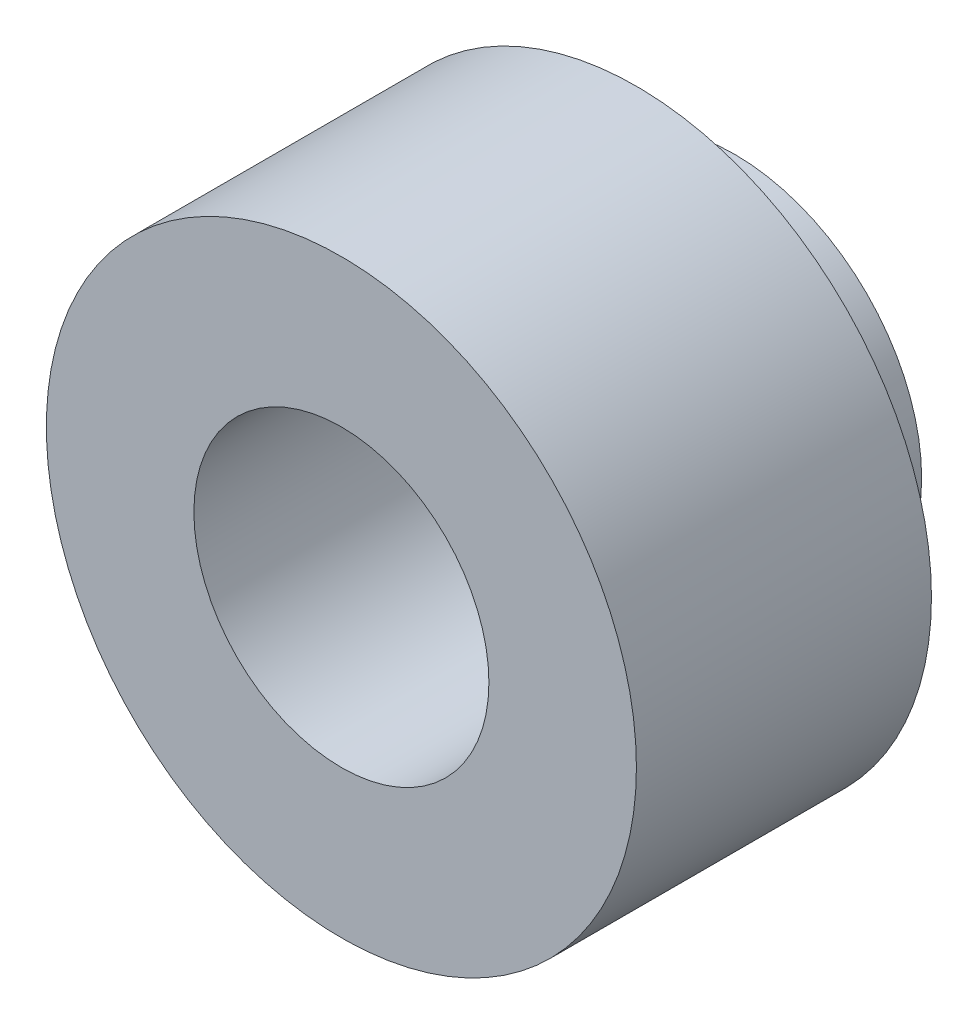
ISO-10303-21;
HEADER;
FILE_DESCRIPTION(('STEP AP214'),'2;1');
FILE_NAME('part.step','',(''),(''),'','','');
FILE_SCHEMA(('AUTOMOTIVE_DESIGN { 1 0 10303 214 1 1 1 1 }'));
ENDSEC;
DATA;
#1=APPLICATION_CONTEXT('core data for automotive mechanical design processes');
#2=APPLICATION_PROTOCOL_DEFINITION('international standard','automotive_design',2000,#1);
#3=PRODUCT_CONTEXT('',#1,'mechanical');
#4=PRODUCT('Part','Part','',(#3));
#5=PRODUCT_RELATED_PRODUCT_CATEGORY('part','',(#4));
#6=PRODUCT_DEFINITION_FORMATION('','',#4);
#7=PRODUCT_DEFINITION_CONTEXT('part definition',#1,'design');
#8=PRODUCT_DEFINITION('design','',#6,#7);
#9=PRODUCT_DEFINITION_SHAPE('','',#8);
#10=(LENGTH_UNIT() NAMED_UNIT(*) SI_UNIT(.MILLI.,.METRE.));
#11=(NAMED_UNIT(*) PLANE_ANGLE_UNIT() SI_UNIT($,.RADIAN.));
#12=(NAMED_UNIT(*) SI_UNIT($,.STERADIAN.) SOLID_ANGLE_UNIT());
#13=UNCERTAINTY_MEASURE_WITH_UNIT(LENGTH_MEASURE(1.E-05),#10,'distance_accuracy_value','');
#14=(GEOMETRIC_REPRESENTATION_CONTEXT(3) GLOBAL_UNCERTAINTY_ASSIGNED_CONTEXT((#13)) GLOBAL_UNIT_ASSIGNED_CONTEXT((#10,
#11,#12)) REPRESENTATION_CONTEXT('',''));
#15=CARTESIAN_POINT('',(0.,0.,0.));
#16=DIRECTION('',(0.,0.,1.));
#17=DIRECTION('',(1.,0.,0.));
#18=AXIS2_PLACEMENT_3D('',#15,#16,#17);
#19=CARTESIAN_POINT('',(0.,0.,0.));
#20=DIRECTION('',(0.,0.,1.));
#21=DIRECTION('',(1.,0.,0.));
#22=AXIS2_PLACEMENT_3D('',#19,#20,#21);
#23=PLANE('',#22);
#24=CARTESIAN_POINT('',(0.,0.,0.));
#25=DIRECTION('',(0.,0.,1.));
#26=DIRECTION('',(1.,0.,0.));
#27=AXIS2_PLACEMENT_3D('',#24,#25,#26);
#28=CIRCLE('',#27,3.75);
#29=CARTESIAN_POINT('',(3.75,0.,0.));
#30=VERTEX_POINT('',#29);
#31=EDGE_CURVE('E56',#30,#30,#28,.T.);
#32=ORIENTED_EDGE('',*,*,#31,.F.);
#33=EDGE_LOOP('',(#32));
#34=FACE_BOUND('',#33,.T.);
#35=CARTESIAN_POINT('',(0.,0.,0.));
#36=DIRECTION('',(0.,0.,1.));
#37=DIRECTION('',(1.,0.,0.));
#38=AXIS2_PLACEMENT_3D('',#35,#36,#37);
#39=CIRCLE('',#38,2.375);
#40=CARTESIAN_POINT('',(2.375,0.,0.));
#41=VERTEX_POINT('',#40);
#42=EDGE_CURVE('E11',#41,#41,#39,.F.);
#43=ORIENTED_EDGE('',*,*,#42,.F.);
#44=EDGE_LOOP('',(#43));
#45=FACE_BOUND('',#44,.T.);
#46=ADVANCED_FACE('F43',(#34,#45),#23,.F.);
#47=CARTESIAN_POINT('',(0.,0.,3.75));
#48=DIRECTION('',(0.,0.,1.));
#49=DIRECTION('',(1.,0.,0.));
#50=AXIS2_PLACEMENT_3D('',#47,#48,#49);
#51=PLANE('',#50);
#52=CARTESIAN_POINT('',(0.,0.,3.75));
#53=DIRECTION('',(0.,0.,1.));
#54=DIRECTION('',(1.,0.,0.));
#55=AXIS2_PLACEMENT_3D('',#52,#53,#54);
#56=CIRCLE('',#55,3.75);
#57=CARTESIAN_POINT('',(3.75,0.,3.75));
#58=VERTEX_POINT('',#57);
#59=EDGE_CURVE('E51',#58,#58,#56,.T.);
#60=ORIENTED_EDGE('',*,*,#59,.T.);
#61=EDGE_LOOP('',(#60));
#62=FACE_BOUND('',#61,.T.);
#63=CARTESIAN_POINT('',(0.,0.,3.75));
#64=DIRECTION('',(0.,0.,1.));
#65=DIRECTION('',(1.,0.,0.));
#66=AXIS2_PLACEMENT_3D('',#63,#64,#65);
#67=CIRCLE('',#66,1.875);
#68=CARTESIAN_POINT('',(1.875,0.,3.75));
#69=VERTEX_POINT('',#68);
#70=EDGE_CURVE('E62',#69,#69,#67,.T.);
#71=ORIENTED_EDGE('',*,*,#70,.F.);
#72=EDGE_LOOP('',(#71));
#73=FACE_BOUND('',#72,.T.);
#74=ADVANCED_FACE('F92',(#62,#73),#51,.T.);
#75=CARTESIAN_POINT('',(0.,0.,3.75));
#76=DIRECTION('',(0.,0.,-1.));
#77=DIRECTION('',(-1.,0.,0.));
#78=AXIS2_PLACEMENT_3D('',#75,#76,#77);
#79=CYLINDRICAL_SURFACE('',#78,3.75);
#80=ORIENTED_EDGE('',*,*,#59,.F.);
#81=EDGE_LOOP('',(#80));
#82=FACE_BOUND('',#81,.T.);
#83=ORIENTED_EDGE('',*,*,#31,.T.);
#84=EDGE_LOOP('',(#83));
#85=FACE_BOUND('',#84,.T.);
#86=ADVANCED_FACE('F45',(#82,#85),#79,.T.);
#87=CARTESIAN_POINT('',(0.,0.,3.75));
#88=DIRECTION('',(0.,0.,-1.));
#89=DIRECTION('',(-1.,0.,0.));
#90=AXIS2_PLACEMENT_3D('',#87,#88,#89);
#91=CYLINDRICAL_SURFACE('',#90,1.875);
#92=ORIENTED_EDGE('',*,*,#70,.T.);
#93=EDGE_LOOP('',(#92));
#94=FACE_BOUND('',#93,.T.);
#95=CARTESIAN_POINT('',(0.,0.,-1.25));
#96=DIRECTION('',(0.,0.,-1.));
#97=DIRECTION('',(-1.,0.,0.));
#98=AXIS2_PLACEMENT_3D('',#95,#96,#97);
#99=CIRCLE('',#98,1.875);
#100=CARTESIAN_POINT('',(-1.875,0.,-1.25));
#101=VERTEX_POINT('',#100);
#102=EDGE_CURVE('E71',#101,#101,#99,.T.);
#103=ORIENTED_EDGE('',*,*,#102,.T.);
#104=EDGE_LOOP('',(#103));
#105=FACE_BOUND('',#104,.T.);
#106=ADVANCED_FACE('F76',(#94,#105),#91,.F.);
#107=CARTESIAN_POINT('',(0.,0.,-1.25));
#108=DIRECTION('',(0.,0.,-1.));
#109=DIRECTION('',(-1.,0.,0.));
#110=AXIS2_PLACEMENT_3D('',#107,#108,#109);
#111=PLANE('',#110);
#112=CARTESIAN_POINT('',(0.,0.,-1.25));
#113=DIRECTION('',(0.,0.,-1.));
#114=DIRECTION('',(-1.,0.,0.));
#115=AXIS2_PLACEMENT_3D('',#112,#113,#114);
#116=CIRCLE('',#115,2.375);
#117=CARTESIAN_POINT('',(-2.375,0.,-1.25));
#118=VERTEX_POINT('',#117);
#119=EDGE_CURVE('E67',#118,#118,#116,.T.);
#120=ORIENTED_EDGE('',*,*,#119,.T.);
#121=EDGE_LOOP('',(#120));
#122=FACE_BOUND('',#121,.T.);
#123=ORIENTED_EDGE('',*,*,#102,.F.);
#124=EDGE_LOOP('',(#123));
#125=FACE_BOUND('',#124,.T.);
#126=ADVANCED_FACE('F78',(#122,#125),#111,.T.);
#127=CARTESIAN_POINT('',(0.,0.,-1.25));
#128=DIRECTION('',(0.,0.,1.));
#129=DIRECTION('',(1.,0.,0.));
#130=AXIS2_PLACEMENT_3D('',#127,#128,#129);
#131=CYLINDRICAL_SURFACE('',#130,2.375);
#132=ORIENTED_EDGE('',*,*,#119,.F.);
#133=EDGE_LOOP('',(#132));
#134=FACE_BOUND('',#133,.T.);
#135=ORIENTED_EDGE('',*,*,#42,.T.);
#136=EDGE_LOOP('',(#135));
#137=FACE_BOUND('',#136,.T.);
#138=ADVANCED_FACE('F80',(#134,#137),#131,.T.);
#139=CLOSED_SHELL('',(#46,#74,#86,#106,#126,#138));
#140=MANIFOLD_SOLID_BREP('B2',#139);
#141=ADVANCED_BREP_SHAPE_REPRESENTATION('',(#18,#140),#14);
#142=SHAPE_DEFINITION_REPRESENTATION(#9,#141);
ENDSEC;
END-ISO-10303-21;
